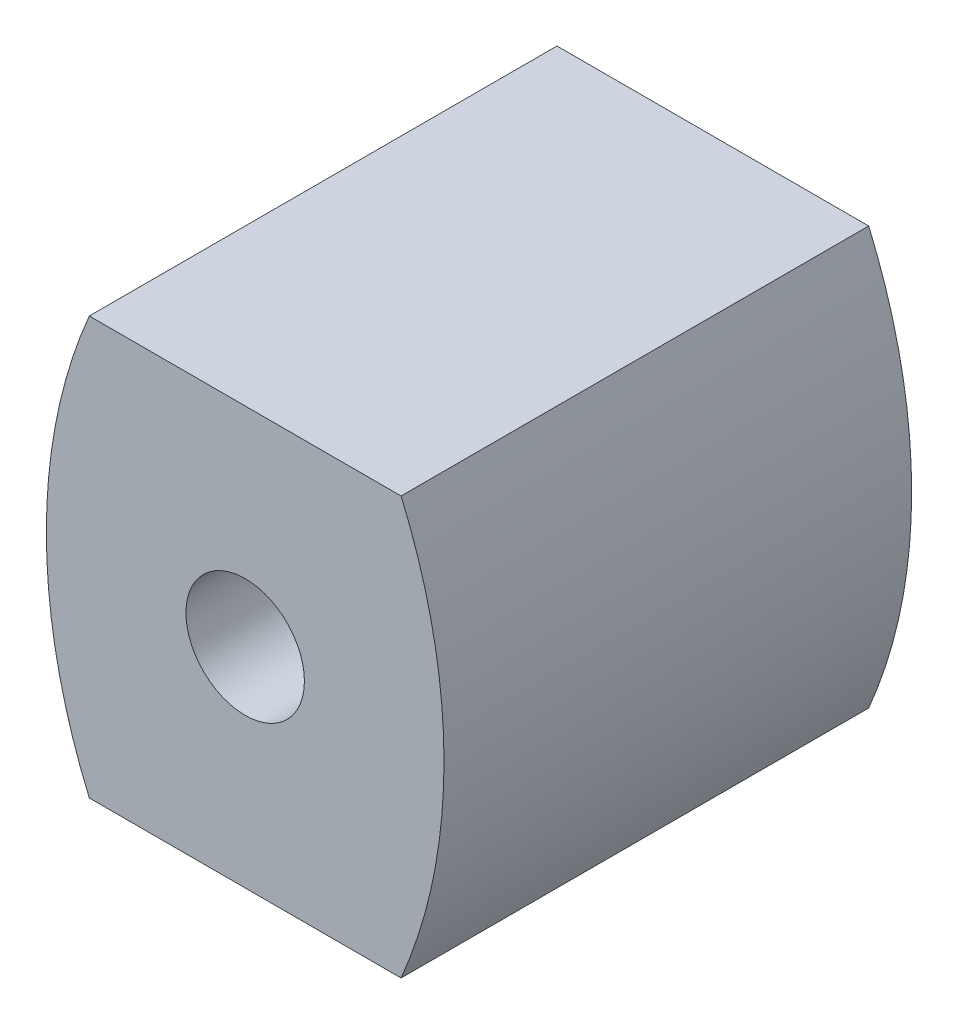
ISO-10303-21;
HEADER;
FILE_DESCRIPTION(('STEP AP214'),'2;1');
FILE_NAME('part.step','',(''),(''),'','','');
FILE_SCHEMA(('AUTOMOTIVE_DESIGN { 1 0 10303 214 1 1 1 1 }'));
ENDSEC;
DATA;
#1=APPLICATION_CONTEXT('core data for automotive mechanical design processes');
#2=APPLICATION_PROTOCOL_DEFINITION('international standard','automotive_design',2000,#1);
#3=PRODUCT_CONTEXT('',#1,'mechanical');
#4=PRODUCT('Part','Part','',(#3));
#5=PRODUCT_RELATED_PRODUCT_CATEGORY('part','',(#4));
#6=PRODUCT_DEFINITION_FORMATION('','',#4);
#7=PRODUCT_DEFINITION_CONTEXT('part definition',#1,'design');
#8=PRODUCT_DEFINITION('design','',#6,#7);
#9=PRODUCT_DEFINITION_SHAPE('','',#8);
#10=(LENGTH_UNIT() NAMED_UNIT(*) SI_UNIT(.MILLI.,.METRE.));
#11=(NAMED_UNIT(*) PLANE_ANGLE_UNIT() SI_UNIT($,.RADIAN.));
#12=(NAMED_UNIT(*) SI_UNIT($,.STERADIAN.) SOLID_ANGLE_UNIT());
#13=UNCERTAINTY_MEASURE_WITH_UNIT(LENGTH_MEASURE(1.E-05),#10,'distance_accuracy_value','');
#14=(GEOMETRIC_REPRESENTATION_CONTEXT(3) GLOBAL_UNCERTAINTY_ASSIGNED_CONTEXT((#13)) GLOBAL_UNIT_ASSIGNED_CONTEXT((#10,
#11,#12)) REPRESENTATION_CONTEXT('',''));
#15=CARTESIAN_POINT('',(0.,0.,0.));
#16=DIRECTION('',(0.,0.,1.));
#17=DIRECTION('',(1.,0.,0.));
#18=AXIS2_PLACEMENT_3D('',#15,#16,#17);
#19=CARTESIAN_POINT('',(-44.3657134653485,-15.8382348490086,15.));
#20=DIRECTION('',(0.,0.,-1.));
#21=DIRECTION('',(-1.,0.,0.));
#22=AXIS2_PLACEMENT_3D('',#19,#20,#21);
#23=CYLINDRICAL_SURFACE('',#22,16.9582730547659);
#24=CARTESIAN_POINT('',(-44.3657134653485,-15.8382348490086,0.));
#25=DIRECTION('',(0.,0.,1.));
#26=DIRECTION('',(1.,0.,0.));
#27=AXIS2_PLACEMENT_3D('',#24,#25,#26);
#28=CIRCLE('',#27,16.9582730547659);
#29=CARTESIAN_POINT('',(-28.7849561024987,-9.14323484900858,0.));
#30=VERTEX_POINT('',#29);
#31=CARTESIAN_POINT('',(-28.7849561024987,-22.5332348490086,0.));
#32=VERTEX_POINT('',#31);
#33=EDGE_CURVE('E106',#30,#32,#28,.F.);
#34=ORIENTED_EDGE('',*,*,#33,.F.);
#35=DIRECTION('',(0.,0.,-1.));
#36=VECTOR('',#35,1.);
#37=CARTESIAN_POINT('',(-28.7849561024987,-9.14323484900858,15.));
#38=LINE('',#37,#36);
#39=CARTESIAN_POINT('',(-28.7849561024987,-9.14323484900858,15.));
#40=VERTEX_POINT('',#39);
#41=EDGE_CURVE('E11',#40,#30,#38,.T.);
#42=ORIENTED_EDGE('',*,*,#41,.F.);
#43=CARTESIAN_POINT('',(-44.3657134653485,-15.8382348490086,15.));
#44=DIRECTION('',(0.,0.,1.));
#45=DIRECTION('',(1.,0.,0.));
#46=AXIS2_PLACEMENT_3D('',#43,#44,#45);
#47=CIRCLE('',#46,16.9582730547659);
#48=CARTESIAN_POINT('',(-28.7849561024987,-22.5332348490086,15.));
#49=VERTEX_POINT('',#48);
#50=EDGE_CURVE('E92',#40,#49,#47,.F.);
#51=ORIENTED_EDGE('',*,*,#50,.T.);
#52=DIRECTION('',(0.,0.,-1.));
#53=VECTOR('',#52,1.);
#54=CARTESIAN_POINT('',(-28.7849561024987,-22.5332348490086,15.));
#55=LINE('',#54,#53);
#56=EDGE_CURVE('E74',#49,#32,#55,.T.);
#57=ORIENTED_EDGE('',*,*,#56,.T.);
#58=EDGE_LOOP('',(#34,#42,#51,#57));
#59=FACE_BOUND('',#58,.T.);
#60=ADVANCED_FACE('F35',(#59),#23,.T.);
#61=CARTESIAN_POINT('',(0.,-9.14323484900858,15.));
#62=DIRECTION('',(0.,-1.,0.));
#63=DIRECTION('',(1.,0.,0.));
#64=AXIS2_PLACEMENT_3D('',#61,#62,#63);
#65=PLANE('',#64);
#66=DIRECTION('',(-1.,0.,0.));
#67=VECTOR('',#66,1.);
#68=CARTESIAN_POINT('',(0.,-9.14323484900858,0.));
#69=LINE('',#68,#67);
#70=CARTESIAN_POINT('',(-38.7849561024987,-9.14323484900859,0.));
#71=VERTEX_POINT('',#70);
#72=EDGE_CURVE('E97',#30,#71,#69,.T.);
#73=ORIENTED_EDGE('',*,*,#72,.T.);
#74=DIRECTION('',(0.,0.,-1.));
#75=VECTOR('',#74,1.);
#76=CARTESIAN_POINT('',(-38.7849561024987,-9.14323484900859,15.));
#77=LINE('',#76,#75);
#78=CARTESIAN_POINT('',(-38.7849561024987,-9.14323484900859,15.));
#79=VERTEX_POINT('',#78);
#80=EDGE_CURVE('E44',#79,#71,#77,.T.);
#81=ORIENTED_EDGE('',*,*,#80,.F.);
#82=DIRECTION('',(-1.,0.,0.));
#83=VECTOR('',#82,1.);
#84=CARTESIAN_POINT('',(0.,-9.14323484900858,15.));
#85=LINE('',#84,#83);
#86=EDGE_CURVE('E89',#40,#79,#85,.T.);
#87=ORIENTED_EDGE('',*,*,#86,.F.);
#88=ORIENTED_EDGE('',*,*,#41,.T.);
#89=EDGE_LOOP('',(#73,#81,#87,#88));
#90=FACE_BOUND('',#89,.T.);
#91=ADVANCED_FACE('F95',(#90),#65,.F.);
#92=CARTESIAN_POINT('',(-23.2041987396488,-15.8382348490086,15.));
#93=DIRECTION('',(0.,0.,-1.));
#94=DIRECTION('',(-1.,0.,0.));
#95=AXIS2_PLACEMENT_3D('',#92,#93,#94);
#96=CYLINDRICAL_SURFACE('',#95,16.9582730547659);
#97=CARTESIAN_POINT('',(-23.2041987396488,-15.8382348490086,0.));
#98=DIRECTION('',(0.,0.,1.));
#99=DIRECTION('',(1.,0.,0.));
#100=AXIS2_PLACEMENT_3D('',#97,#98,#99);
#101=CIRCLE('',#100,16.9582730547659);
#102=CARTESIAN_POINT('',(-38.7849561024987,-22.5332348490086,0.));
#103=VERTEX_POINT('',#102);
#104=EDGE_CURVE('E103',#71,#103,#101,.T.);
#105=ORIENTED_EDGE('',*,*,#104,.T.);
#106=DIRECTION('',(0.,0.,-1.));
#107=VECTOR('',#106,1.);
#108=CARTESIAN_POINT('',(-38.7849561024987,-22.5332348490086,15.));
#109=LINE('',#108,#107);
#110=CARTESIAN_POINT('',(-38.7849561024987,-22.5332348490086,15.));
#111=VERTEX_POINT('',#110);
#112=EDGE_CURVE('E88',#111,#103,#109,.T.);
#113=ORIENTED_EDGE('',*,*,#112,.F.);
#114=CARTESIAN_POINT('',(-23.2041987396488,-15.8382348490086,15.));
#115=DIRECTION('',(0.,0.,1.));
#116=DIRECTION('',(1.,0.,0.));
#117=AXIS2_PLACEMENT_3D('',#114,#115,#116);
#118=CIRCLE('',#117,16.9582730547659);
#119=EDGE_CURVE('E82',#79,#111,#118,.T.);
#120=ORIENTED_EDGE('',*,*,#119,.F.);
#121=ORIENTED_EDGE('',*,*,#80,.T.);
#122=EDGE_LOOP('',(#105,#113,#120,#121));
#123=FACE_BOUND('',#122,.T.);
#124=ADVANCED_FACE('F85',(#123),#96,.T.);
#125=CARTESIAN_POINT('',(-33.7849561024987,-15.8382348490086,15.));
#126=DIRECTION('',(0.,0.,-1.));
#127=DIRECTION('',(-1.,0.,0.));
#128=AXIS2_PLACEMENT_3D('',#125,#126,#127);
#129=CYLINDRICAL_SURFACE('',#128,1.9);
#130=CARTESIAN_POINT('',(-33.7849561024987,-15.8382348490086,15.));
#131=DIRECTION('',(0.,0.,1.));
#132=DIRECTION('',(1.,0.,0.));
#133=AXIS2_PLACEMENT_3D('',#130,#131,#132);
#134=CIRCLE('',#133,1.9);
#135=CARTESIAN_POINT('',(-31.8849561024987,-15.8382348490086,15.));
#136=VERTEX_POINT('',#135);
#137=EDGE_CURVE('E102',#136,#136,#134,.T.);
#138=ORIENTED_EDGE('',*,*,#137,.T.);
#139=EDGE_LOOP('',(#138));
#140=FACE_BOUND('',#139,.T.);
#141=CARTESIAN_POINT('',(-33.7849561024987,-15.8382348490086,0.));
#142=DIRECTION('',(0.,0.,1.));
#143=DIRECTION('',(1.,0.,0.));
#144=AXIS2_PLACEMENT_3D('',#141,#142,#143);
#145=CIRCLE('',#144,1.9);
#146=CARTESIAN_POINT('',(-31.8849561024987,-15.8382348490086,0.));
#147=VERTEX_POINT('',#146);
#148=EDGE_CURVE('E108',#147,#147,#145,.T.);
#149=ORIENTED_EDGE('',*,*,#148,.F.);
#150=EDGE_LOOP('',(#149));
#151=FACE_BOUND('',#150,.T.);
#152=ADVANCED_FACE('F37',(#140,#151),#129,.F.);
#153=CARTESIAN_POINT('',(0.,-22.5332348490086,15.));
#154=DIRECTION('',(0.,1.,0.));
#155=DIRECTION('',(0.,0.,1.));
#156=AXIS2_PLACEMENT_3D('',#153,#154,#155);
#157=PLANE('',#156);
#158=DIRECTION('',(1.,0.,0.));
#159=VECTOR('',#158,1.);
#160=CARTESIAN_POINT('',(0.,-22.5332348490086,0.));
#161=LINE('',#160,#159);
#162=EDGE_CURVE('E67',#103,#32,#161,.T.);
#163=ORIENTED_EDGE('',*,*,#162,.T.);
#164=ORIENTED_EDGE('',*,*,#56,.F.);
#165=DIRECTION('',(1.,0.,0.));
#166=VECTOR('',#165,1.);
#167=CARTESIAN_POINT('',(0.,-22.5332348490086,15.));
#168=LINE('',#167,#166);
#169=EDGE_CURVE('E52',#111,#49,#168,.T.);
#170=ORIENTED_EDGE('',*,*,#169,.F.);
#171=ORIENTED_EDGE('',*,*,#112,.T.);
#172=EDGE_LOOP('',(#163,#164,#170,#171));
#173=FACE_BOUND('',#172,.T.);
#174=ADVANCED_FACE('F120',(#173),#157,.F.);
#175=CARTESIAN_POINT('',(0.,0.,15.));
#176=DIRECTION('',(0.,0.,1.));
#177=DIRECTION('',(1.,0.,0.));
#178=AXIS2_PLACEMENT_3D('',#175,#176,#177);
#179=PLANE('',#178);
#180=ORIENTED_EDGE('',*,*,#137,.F.);
#181=EDGE_LOOP('',(#180));
#182=FACE_BOUND('',#181,.T.);
#183=ORIENTED_EDGE('',*,*,#50,.F.);
#184=ORIENTED_EDGE('',*,*,#86,.T.);
#185=ORIENTED_EDGE('',*,*,#119,.T.);
#186=ORIENTED_EDGE('',*,*,#169,.T.);
#187=EDGE_LOOP('',(#183,#184,#185,#186));
#188=FACE_BOUND('',#187,.T.);
#189=ADVANCED_FACE('F91',(#182,#188),#179,.T.);
#190=CARTESIAN_POINT('',(0.,0.,0.));
#191=DIRECTION('',(0.,0.,1.));
#192=DIRECTION('',(1.,0.,0.));
#193=AXIS2_PLACEMENT_3D('',#190,#191,#192);
#194=PLANE('',#193);
#195=ORIENTED_EDGE('',*,*,#148,.T.);
#196=EDGE_LOOP('',(#195));
#197=FACE_BOUND('',#196,.T.);
#198=ORIENTED_EDGE('',*,*,#33,.T.);
#199=ORIENTED_EDGE('',*,*,#162,.F.);
#200=ORIENTED_EDGE('',*,*,#104,.F.);
#201=ORIENTED_EDGE('',*,*,#72,.F.);
#202=EDGE_LOOP('',(#198,#199,#200,#201));
#203=FACE_BOUND('',#202,.T.);
#204=ADVANCED_FACE('F119',(#197,#203),#194,.F.);
#205=CLOSED_SHELL('',(#60,#91,#124,#152,#174,#189,#204));
#206=MANIFOLD_SOLID_BREP('B2',#205);
#207=ADVANCED_BREP_SHAPE_REPRESENTATION('',(#18,#206),#14);
#208=SHAPE_DEFINITION_REPRESENTATION(#9,#207);
ENDSEC;
END-ISO-10303-21;
